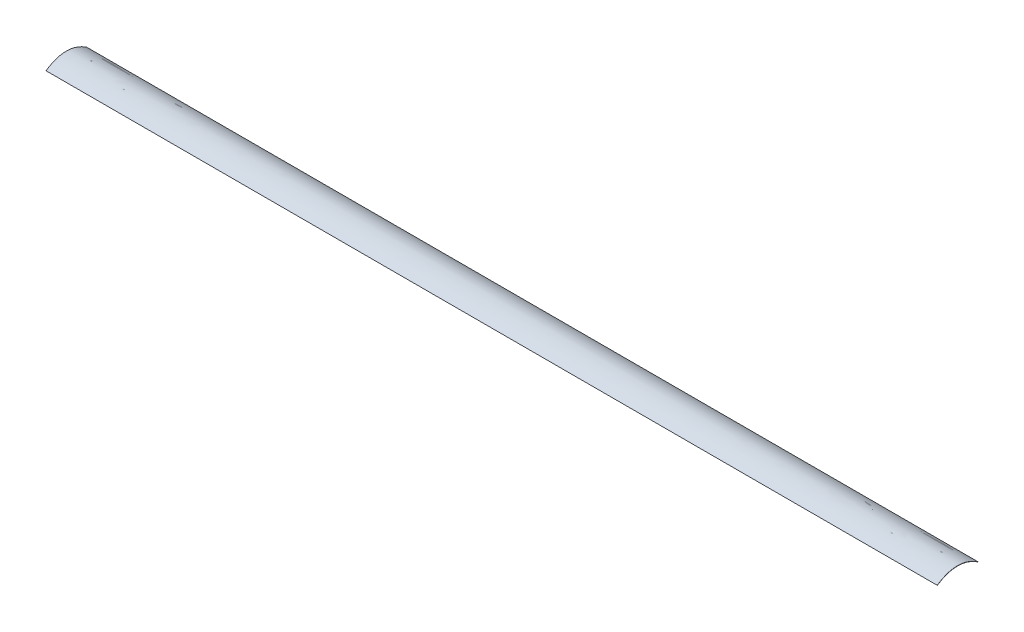
ISO-10303-21;
HEADER;
FILE_DESCRIPTION(('STEP AP214'),'2;1');
FILE_NAME('part.step','',(''),(''),'','','');
FILE_SCHEMA(('AUTOMOTIVE_DESIGN { 1 0 10303 214 1 1 1 1 }'));
ENDSEC;
DATA;
#1=APPLICATION_CONTEXT('core data for automotive mechanical design processes');
#2=APPLICATION_PROTOCOL_DEFINITION('international standard','automotive_design',2000,#1);
#3=PRODUCT_CONTEXT('',#1,'mechanical');
#4=PRODUCT('Part','Part','',(#3));
#5=PRODUCT_RELATED_PRODUCT_CATEGORY('part','',(#4));
#6=PRODUCT_DEFINITION_FORMATION('','',#4);
#7=PRODUCT_DEFINITION_CONTEXT('part definition',#1,'design');
#8=PRODUCT_DEFINITION('design','',#6,#7);
#9=PRODUCT_DEFINITION_SHAPE('','',#8);
#10=(LENGTH_UNIT() NAMED_UNIT(*) SI_UNIT(.MILLI.,.METRE.));
#11=(NAMED_UNIT(*) PLANE_ANGLE_UNIT() SI_UNIT($,.RADIAN.));
#12=(NAMED_UNIT(*) SI_UNIT($,.STERADIAN.) SOLID_ANGLE_UNIT());
#13=UNCERTAINTY_MEASURE_WITH_UNIT(LENGTH_MEASURE(1.E-05),#10,'distance_accuracy_value','');
#14=(GEOMETRIC_REPRESENTATION_CONTEXT(3) GLOBAL_UNCERTAINTY_ASSIGNED_CONTEXT((#13)) GLOBAL_UNIT_ASSIGNED_CONTEXT((#10,
#11,#12)) REPRESENTATION_CONTEXT('',''));
#15=CARTESIAN_POINT('',(0.,0.,0.));
#16=DIRECTION('',(0.,0.,1.));
#17=DIRECTION('',(1.,0.,0.));
#18=AXIS2_PLACEMENT_3D('',#15,#16,#17);
#19=CARTESIAN_POINT('',(165.1,0.,-7.55));
#20=CARTESIAN_POINT('',(165.1,5.1,0.));
#21=CARTESIAN_POINT('',(165.1,0.,7.55));
#22=B_SPLINE_CURVE_WITH_KNOTS('',2,(#19,#20,#21),.UNSPECIFIED.,.F.,.F.,(3,3),(0.,1.),.UNSPECIFIED.);
#23=DIRECTION('',(-1.,0.,0.));
#24=VECTOR('',#23,1.);
#25=SURFACE_OF_LINEAR_EXTRUSION('',#22,#24);
#26=CARTESIAN_POINT('',(-165.1,0.,-7.55));
#27=CARTESIAN_POINT('',(-165.1,5.1,0.));
#28=CARTESIAN_POINT('',(-165.1,0.,7.55));
#29=B_SPLINE_CURVE_WITH_KNOTS('',2,(#26,#27,#28),.UNSPECIFIED.,.F.,.F.,(3,3),(0.,1.),.UNSPECIFIED.);
#30=CARTESIAN_POINT('',(-165.1,0.,-7.55));
#31=VERTEX_POINT('',#30);
#32=CARTESIAN_POINT('',(-165.1,0.,7.55));
#33=VERTEX_POINT('',#32);
#34=EDGE_CURVE('E119',#31,#33,#29,.T.);
#35=ORIENTED_EDGE('',*,*,#34,.T.);
#36=DIRECTION('',(-1.,0.,0.));
#37=VECTOR('',#36,1.);
#38=CARTESIAN_POINT('',(165.1,0.,7.55));
#39=LINE('',#38,#37);
#40=CARTESIAN_POINT('',(165.1,0.,7.55));
#41=VERTEX_POINT('',#40);
#42=EDGE_CURVE('E11',#41,#33,#39,.T.);
#43=ORIENTED_EDGE('',*,*,#42,.F.);
#44=CARTESIAN_POINT('',(165.1,0.,-7.55));
#45=VERTEX_POINT('',#44);
#46=EDGE_CURVE('E88',#45,#41,#22,.T.);
#47=ORIENTED_EDGE('',*,*,#46,.F.);
#48=DIRECTION('',(-1.,0.,0.));
#49=VECTOR('',#48,1.);
#50=CARTESIAN_POINT('',(165.1,0.,-7.55));
#51=LINE('',#50,#49);
#52=EDGE_CURVE('E96',#45,#31,#51,.T.);
#53=ORIENTED_EDGE('',*,*,#52,.T.);
#54=EDGE_LOOP('',(#35,#43,#47,#53));
#55=FACE_BOUND('',#54,.T.);
#56=ADVANCED_FACE('F36',(#55),#25,.F.);
#57=CARTESIAN_POINT('',(165.1,0.,7.45));
#58=DIRECTION('',(0.,1.,0.));
#59=DIRECTION('',(0.,0.,1.));
#60=AXIS2_PLACEMENT_3D('',#57,#58,#59);
#61=PLANE('',#60);
#62=DIRECTION('',(0.,0.,-1.));
#63=VECTOR('',#62,1.);
#64=CARTESIAN_POINT('',(-165.1,0.,7.45));
#65=LINE('',#64,#63);
#66=CARTESIAN_POINT('',(-165.1,0.,7.45));
#67=VERTEX_POINT('',#66);
#68=EDGE_CURVE('E92',#33,#67,#65,.T.);
#69=ORIENTED_EDGE('',*,*,#68,.T.);
#70=DIRECTION('',(-1.,0.,0.));
#71=VECTOR('',#70,1.);
#72=CARTESIAN_POINT('',(165.1,0.,7.45));
#73=LINE('',#72,#71);
#74=CARTESIAN_POINT('',(165.1,0.,7.45));
#75=VERTEX_POINT('',#74);
#76=EDGE_CURVE('E45',#75,#67,#73,.T.);
#77=ORIENTED_EDGE('',*,*,#76,.F.);
#78=DIRECTION('',(0.,0.,-1.));
#79=VECTOR('',#78,1.);
#80=CARTESIAN_POINT('',(165.1,0.,7.45));
#81=LINE('',#80,#79);
#82=EDGE_CURVE('E83',#41,#75,#81,.T.);
#83=ORIENTED_EDGE('',*,*,#82,.F.);
#84=ORIENTED_EDGE('',*,*,#42,.T.);
#85=EDGE_LOOP('',(#69,#77,#83,#84));
#86=FACE_BOUND('',#85,.T.);
#87=ADVANCED_FACE('F91',(#86),#61,.F.);
#88=CARTESIAN_POINT('',(165.1,0.,7.45));
#89=CARTESIAN_POINT('',(165.1,4.9,0.));
#90=CARTESIAN_POINT('',(165.1,0.,-7.45));
#91=B_SPLINE_CURVE_WITH_KNOTS('',2,(#88,#89,#90),.UNSPECIFIED.,.F.,.F.,(3,3),(0.,1.),.UNSPECIFIED.);
#92=DIRECTION('',(-1.,0.,0.));
#93=VECTOR('',#92,1.);
#94=SURFACE_OF_LINEAR_EXTRUSION('',#91,#93);
#95=CARTESIAN_POINT('',(-165.1,0.,7.45));
#96=CARTESIAN_POINT('',(-165.1,4.9,0.));
#97=CARTESIAN_POINT('',(-165.1,0.,-7.45));
#98=B_SPLINE_CURVE_WITH_KNOTS('',2,(#95,#96,#97),.UNSPECIFIED.,.F.,.F.,(3,3),(0.,1.),.UNSPECIFIED.);
#99=CARTESIAN_POINT('',(-165.1,0.,-7.45));
#100=VERTEX_POINT('',#99);
#101=EDGE_CURVE('E70',#67,#100,#98,.T.);
#102=ORIENTED_EDGE('',*,*,#101,.T.);
#103=DIRECTION('',(-1.,0.,0.));
#104=VECTOR('',#103,1.);
#105=CARTESIAN_POINT('',(165.1,0.,-7.45));
#106=LINE('',#105,#104);
#107=CARTESIAN_POINT('',(165.1,0.,-7.45));
#108=VERTEX_POINT('',#107);
#109=EDGE_CURVE('E93',#108,#100,#106,.T.);
#110=ORIENTED_EDGE('',*,*,#109,.F.);
#111=EDGE_CURVE('E86',#75,#108,#91,.T.);
#112=ORIENTED_EDGE('',*,*,#111,.F.);
#113=ORIENTED_EDGE('',*,*,#76,.T.);
#114=EDGE_LOOP('',(#102,#110,#112,#113));
#115=FACE_BOUND('',#114,.T.);
#116=ADVANCED_FACE('F94',(#115),#94,.F.);
#117=CARTESIAN_POINT('',(165.1,0.,-7.55));
#118=DIRECTION('',(0.,1.,0.));
#119=DIRECTION('',(0.,0.,1.));
#120=AXIS2_PLACEMENT_3D('',#117,#118,#119);
#121=PLANE('',#120);
#122=DIRECTION('',(0.,0.,-1.));
#123=VECTOR('',#122,1.);
#124=CARTESIAN_POINT('',(-165.1,0.,-7.55));
#125=LINE('',#124,#123);
#126=EDGE_CURVE('E76',#100,#31,#125,.T.);
#127=ORIENTED_EDGE('',*,*,#126,.T.);
#128=ORIENTED_EDGE('',*,*,#52,.F.);
#129=DIRECTION('',(0.,0.,-1.));
#130=VECTOR('',#129,1.);
#131=CARTESIAN_POINT('',(165.1,0.,-7.55));
#132=LINE('',#131,#130);
#133=EDGE_CURVE('E53',#108,#45,#132,.T.);
#134=ORIENTED_EDGE('',*,*,#133,.F.);
#135=ORIENTED_EDGE('',*,*,#109,.T.);
#136=EDGE_LOOP('',(#127,#128,#134,#135));
#137=FACE_BOUND('',#136,.T.);
#138=ADVANCED_FACE('F108',(#137),#121,.F.);
#139=CARTESIAN_POINT('',(165.1,2.55,0.));
#140=DIRECTION('',(-1.,0.,0.));
#141=DIRECTION('',(0.,0.,1.));
#142=AXIS2_PLACEMENT_3D('',#139,#140,#141);
#143=PLANE('',#142);
#144=ORIENTED_EDGE('',*,*,#46,.T.);
#145=ORIENTED_EDGE('',*,*,#82,.T.);
#146=ORIENTED_EDGE('',*,*,#111,.T.);
#147=ORIENTED_EDGE('',*,*,#133,.T.);
#148=EDGE_LOOP('',(#144,#145,#146,#147));
#149=FACE_BOUND('',#148,.T.);
#150=ADVANCED_FACE('F84',(#149),#143,.F.);
#151=CARTESIAN_POINT('',(-165.1,2.55,0.));
#152=DIRECTION('',(-1.,0.,0.));
#153=DIRECTION('',(0.,0.,1.));
#154=AXIS2_PLACEMENT_3D('',#151,#152,#153);
#155=PLANE('',#154);
#156=ORIENTED_EDGE('',*,*,#34,.F.);
#157=ORIENTED_EDGE('',*,*,#126,.F.);
#158=ORIENTED_EDGE('',*,*,#101,.F.);
#159=ORIENTED_EDGE('',*,*,#68,.F.);
#160=EDGE_LOOP('',(#156,#157,#158,#159));
#161=FACE_BOUND('',#160,.T.);
#162=ADVANCED_FACE('F136',(#161),#155,.T.);
#163=CLOSED_SHELL('',(#56,#87,#116,#138,#150,#162));
#164=MANIFOLD_SOLID_BREP('B2',#163);
#165=ADVANCED_BREP_SHAPE_REPRESENTATION('',(#18,#164),#14);
#166=SHAPE_DEFINITION_REPRESENTATION(#9,#165);
ENDSEC;
END-ISO-10303-21;
